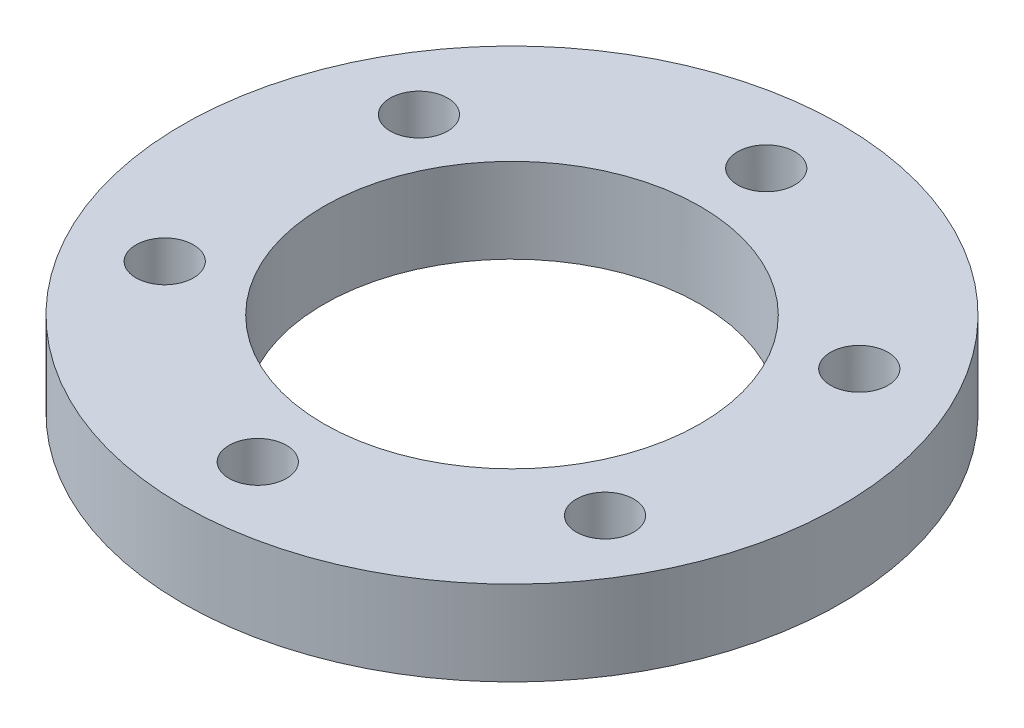
ISO-10303-21;
HEADER;
FILE_DESCRIPTION(('STEP AP214'),'2;1');
FILE_NAME('part.step','',(''),(''),'','','');
FILE_SCHEMA(('AUTOMOTIVE_DESIGN { 1 0 10303 214 1 1 1 1 }'));
ENDSEC;
DATA;
#1=APPLICATION_CONTEXT('core data for automotive mechanical design processes');
#2=APPLICATION_PROTOCOL_DEFINITION('international standard','automotive_design',2000,#1);
#3=PRODUCT_CONTEXT('',#1,'mechanical');
#4=PRODUCT('Part','Part','',(#3));
#5=PRODUCT_RELATED_PRODUCT_CATEGORY('part','',(#4));
#6=PRODUCT_DEFINITION_FORMATION('','',#4);
#7=PRODUCT_DEFINITION_CONTEXT('part definition',#1,'design');
#8=PRODUCT_DEFINITION('design','',#6,#7);
#9=PRODUCT_DEFINITION_SHAPE('','',#8);
#10=(LENGTH_UNIT() NAMED_UNIT(*) SI_UNIT(.MILLI.,.METRE.));
#11=(NAMED_UNIT(*) PLANE_ANGLE_UNIT() SI_UNIT($,.RADIAN.));
#12=(NAMED_UNIT(*) SI_UNIT($,.STERADIAN.) SOLID_ANGLE_UNIT());
#13=UNCERTAINTY_MEASURE_WITH_UNIT(LENGTH_MEASURE(1.E-05),#10,'distance_accuracy_value','');
#14=(GEOMETRIC_REPRESENTATION_CONTEXT(3) GLOBAL_UNCERTAINTY_ASSIGNED_CONTEXT((#13)) GLOBAL_UNIT_ASSIGNED_CONTEXT((#10,
#11,#12)) REPRESENTATION_CONTEXT('',''));
#15=CARTESIAN_POINT('',(0.,0.,0.));
#16=DIRECTION('',(0.,0.,1.));
#17=DIRECTION('',(1.,0.,0.));
#18=AXIS2_PLACEMENT_3D('',#15,#16,#17);
#19=CARTESIAN_POINT('',(0.,4.5,0.));
#20=DIRECTION('',(0.,1.,0.));
#21=DIRECTION('',(0.,0.,1.));
#22=AXIS2_PLACEMENT_3D('',#19,#20,#21);
#23=PLANE('',#22);
#24=CARTESIAN_POINT('',(11.6913429510899,4.5,6.75));
#25=DIRECTION('',(0.,1.,0.));
#26=DIRECTION('',(0.,0.,1.));
#27=AXIS2_PLACEMENT_3D('',#24,#25,#26);
#28=CIRCLE('',#27,1.525);
#29=CARTESIAN_POINT('',(11.6913429510899,4.5,8.275));
#30=VERTEX_POINT('',#29);
#31=EDGE_CURVE('E51',#30,#30,#28,.F.);
#32=ORIENTED_EDGE('',*,*,#31,.T.);
#33=EDGE_LOOP('',(#32));
#34=FACE_BOUND('',#33,.T.);
#35=CARTESIAN_POINT('',(11.6913429510899,4.5,-6.75));
#36=DIRECTION('',(0.,1.,0.));
#37=DIRECTION('',(0.,0.,1.));
#38=AXIS2_PLACEMENT_3D('',#35,#36,#37);
#39=CIRCLE('',#38,1.525);
#40=CARTESIAN_POINT('',(11.6913429510899,4.5,-5.225));
#41=VERTEX_POINT('',#40);
#42=EDGE_CURVE('E66',#41,#41,#39,.F.);
#43=ORIENTED_EDGE('',*,*,#42,.T.);
#44=EDGE_LOOP('',(#43));
#45=FACE_BOUND('',#44,.T.);
#46=CARTESIAN_POINT('',(0.,4.5,-13.5));
#47=DIRECTION('',(0.,1.,0.));
#48=DIRECTION('',(0.,0.,1.));
#49=AXIS2_PLACEMENT_3D('',#46,#47,#48);
#50=CIRCLE('',#49,1.525);
#51=CARTESIAN_POINT('',(0.,4.5,-11.975));
#52=VERTEX_POINT('',#51);
#53=EDGE_CURVE('E72',#52,#52,#50,.F.);
#54=ORIENTED_EDGE('',*,*,#53,.T.);
#55=EDGE_LOOP('',(#54));
#56=FACE_BOUND('',#55,.T.);
#57=CARTESIAN_POINT('',(-11.6913429510899,4.5,-6.75000000000001));
#58=DIRECTION('',(0.,1.,0.));
#59=DIRECTION('',(0.,0.,1.));
#60=AXIS2_PLACEMENT_3D('',#57,#58,#59);
#61=CIRCLE('',#60,1.525);
#62=CARTESIAN_POINT('',(-11.6913429510899,4.5,-5.225));
#63=VERTEX_POINT('',#62);
#64=EDGE_CURVE('E42',#63,#63,#61,.F.);
#65=ORIENTED_EDGE('',*,*,#64,.T.);
#66=EDGE_LOOP('',(#65));
#67=FACE_BOUND('',#66,.T.);
#68=CARTESIAN_POINT('',(-11.6913429510899,4.5,6.75));
#69=DIRECTION('',(0.,1.,0.));
#70=DIRECTION('',(0.,0.,1.));
#71=AXIS2_PLACEMENT_3D('',#68,#69,#70);
#72=CIRCLE('',#71,1.525);
#73=CARTESIAN_POINT('',(-11.6913429510899,4.5,8.275));
#74=VERTEX_POINT('',#73);
#75=EDGE_CURVE('E58',#74,#74,#72,.F.);
#76=ORIENTED_EDGE('',*,*,#75,.T.);
#77=EDGE_LOOP('',(#76));
#78=FACE_BOUND('',#77,.T.);
#79=CARTESIAN_POINT('',(0.,4.5,13.5));
#80=DIRECTION('',(0.,1.,0.));
#81=DIRECTION('',(0.,0.,1.));
#82=AXIS2_PLACEMENT_3D('',#79,#80,#81);
#83=CIRCLE('',#82,1.525);
#84=CARTESIAN_POINT('',(0.,4.5,15.025));
#85=VERTEX_POINT('',#84);
#86=EDGE_CURVE('E10',#85,#85,#83,.F.);
#87=ORIENTED_EDGE('',*,*,#86,.T.);
#88=EDGE_LOOP('',(#87));
#89=FACE_BOUND('',#88,.T.);
#90=CARTESIAN_POINT('',(0.,4.5,0.));
#91=DIRECTION('',(0.,1.,0.));
#92=DIRECTION('',(0.,0.,1.));
#93=AXIS2_PLACEMENT_3D('',#90,#91,#92);
#94=CIRCLE('',#93,10.);
#95=CARTESIAN_POINT('',(0.,4.5,10.));
#96=VERTEX_POINT('',#95);
#97=EDGE_CURVE('E59',#96,#96,#94,.F.);
#98=ORIENTED_EDGE('',*,*,#97,.T.);
#99=EDGE_LOOP('',(#98));
#100=FACE_BOUND('',#99,.T.);
#101=CARTESIAN_POINT('',(0.,4.5,0.));
#102=DIRECTION('',(0.,-1.,0.));
#103=DIRECTION('',(0.,0.,-1.));
#104=AXIS2_PLACEMENT_3D('',#101,#102,#103);
#105=CIRCLE('',#104,17.5);
#106=CARTESIAN_POINT('',(0.,4.5,-17.5));
#107=VERTEX_POINT('',#106);
#108=EDGE_CURVE('E140',#107,#107,#105,.T.);
#109=ORIENTED_EDGE('',*,*,#108,.F.);
#110=EDGE_LOOP('',(#109));
#111=FACE_BOUND('',#110,.T.);
#112=ADVANCED_FACE('F38',(#34,#45,#56,#67,#78,#89,#100,#111),#23,.T.);
#113=CARTESIAN_POINT('',(0.,0.,0.));
#114=DIRECTION('',(0.,1.,0.));
#115=DIRECTION('',(0.,0.,1.));
#116=AXIS2_PLACEMENT_3D('',#113,#114,#115);
#117=PLANE('',#116);
#118=CARTESIAN_POINT('',(11.6913429510899,0.,6.75));
#119=DIRECTION('',(0.,-1.,0.));
#120=DIRECTION('',(0.,0.,-1.));
#121=AXIS2_PLACEMENT_3D('',#118,#119,#120);
#122=CIRCLE('',#121,1.525);
#123=CARTESIAN_POINT('',(11.6913429510899,0.,5.225));
#124=VERTEX_POINT('',#123);
#125=EDGE_CURVE('E63',#124,#124,#122,.T.);
#126=ORIENTED_EDGE('',*,*,#125,.F.);
#127=EDGE_LOOP('',(#126));
#128=FACE_BOUND('',#127,.T.);
#129=CARTESIAN_POINT('',(11.6913429510899,0.,-6.75));
#130=DIRECTION('',(0.,-1.,0.));
#131=DIRECTION('',(0.,0.,-1.));
#132=AXIS2_PLACEMENT_3D('',#129,#130,#131);
#133=CIRCLE('',#132,1.525);
#134=CARTESIAN_POINT('',(11.6913429510899,0.,-8.275));
#135=VERTEX_POINT('',#134);
#136=EDGE_CURVE('E69',#135,#135,#133,.T.);
#137=ORIENTED_EDGE('',*,*,#136,.F.);
#138=EDGE_LOOP('',(#137));
#139=FACE_BOUND('',#138,.T.);
#140=CARTESIAN_POINT('',(0.,0.,-13.5));
#141=DIRECTION('',(0.,-1.,0.));
#142=DIRECTION('',(0.,0.,-1.));
#143=AXIS2_PLACEMENT_3D('',#140,#141,#142);
#144=CIRCLE('',#143,1.525);
#145=CARTESIAN_POINT('',(0.,0.,-15.025));
#146=VERTEX_POINT('',#145);
#147=EDGE_CURVE('E75',#146,#146,#144,.T.);
#148=ORIENTED_EDGE('',*,*,#147,.F.);
#149=EDGE_LOOP('',(#148));
#150=FACE_BOUND('',#149,.T.);
#151=CARTESIAN_POINT('',(-11.6913429510899,0.,-6.75000000000001));
#152=DIRECTION('',(0.,-1.,0.));
#153=DIRECTION('',(0.,0.,-1.));
#154=AXIS2_PLACEMENT_3D('',#151,#152,#153);
#155=CIRCLE('',#154,1.525);
#156=CARTESIAN_POINT('',(-11.6913429510899,0.,-8.27500000000001));
#157=VERTEX_POINT('',#156);
#158=EDGE_CURVE('E62',#157,#157,#155,.T.);
#159=ORIENTED_EDGE('',*,*,#158,.F.);
#160=EDGE_LOOP('',(#159));
#161=FACE_BOUND('',#160,.T.);
#162=CARTESIAN_POINT('',(-11.6913429510899,0.,6.75));
#163=DIRECTION('',(0.,-1.,0.));
#164=DIRECTION('',(0.,0.,-1.));
#165=AXIS2_PLACEMENT_3D('',#162,#163,#164);
#166=CIRCLE('',#165,1.525);
#167=CARTESIAN_POINT('',(-11.6913429510899,0.,5.225));
#168=VERTEX_POINT('',#167);
#169=EDGE_CURVE('E55',#168,#168,#166,.T.);
#170=ORIENTED_EDGE('',*,*,#169,.F.);
#171=EDGE_LOOP('',(#170));
#172=FACE_BOUND('',#171,.T.);
#173=CARTESIAN_POINT('',(0.,0.,13.5));
#174=DIRECTION('',(0.,-1.,0.));
#175=DIRECTION('',(0.,0.,-1.));
#176=AXIS2_PLACEMENT_3D('',#173,#174,#175);
#177=CIRCLE('',#176,1.525);
#178=CARTESIAN_POINT('',(0.,0.,11.975));
#179=VERTEX_POINT('',#178);
#180=EDGE_CURVE('E46',#179,#179,#177,.T.);
#181=ORIENTED_EDGE('',*,*,#180,.F.);
#182=EDGE_LOOP('',(#181));
#183=FACE_BOUND('',#182,.T.);
#184=CARTESIAN_POINT('',(0.,0.,0.));
#185=DIRECTION('',(0.,-1.,0.));
#186=DIRECTION('',(0.,0.,-1.));
#187=AXIS2_PLACEMENT_3D('',#184,#185,#186);
#188=CIRCLE('',#187,10.);
#189=CARTESIAN_POINT('',(0.,0.,-10.));
#190=VERTEX_POINT('',#189);
#191=EDGE_CURVE('E146',#190,#190,#188,.T.);
#192=ORIENTED_EDGE('',*,*,#191,.F.);
#193=EDGE_LOOP('',(#192));
#194=FACE_BOUND('',#193,.T.);
#195=CARTESIAN_POINT('',(0.,0.,0.));
#196=DIRECTION('',(0.,-1.,0.));
#197=DIRECTION('',(0.,0.,-1.));
#198=AXIS2_PLACEMENT_3D('',#195,#196,#197);
#199=CIRCLE('',#198,17.5);
#200=CARTESIAN_POINT('',(0.,0.,-17.5));
#201=VERTEX_POINT('',#200);
#202=EDGE_CURVE('E143',#201,#201,#199,.T.);
#203=ORIENTED_EDGE('',*,*,#202,.T.);
#204=EDGE_LOOP('',(#203));
#205=FACE_BOUND('',#204,.T.);
#206=ADVANCED_FACE('F40',(#128,#139,#150,#161,#172,#183,#194,#205),#117,.F.);
#207=CARTESIAN_POINT('',(11.6913429510899,8.81335136523794,6.75));
#208=DIRECTION('',(0.,-1.,0.));
#209=DIRECTION('',(0.,0.,-1.));
#210=AXIS2_PLACEMENT_3D('',#207,#208,#209);
#211=CYLINDRICAL_SURFACE('',#210,1.525);
#212=ORIENTED_EDGE('',*,*,#125,.T.);
#213=EDGE_LOOP('',(#212));
#214=FACE_BOUND('',#213,.T.);
#215=ORIENTED_EDGE('',*,*,#31,.F.);
#216=EDGE_LOOP('',(#215));
#217=FACE_BOUND('',#216,.T.);
#218=ADVANCED_FACE('F107',(#214,#217),#211,.F.);
#219=CARTESIAN_POINT('',(11.6913429510899,8.81335136523794,-6.75));
#220=DIRECTION('',(0.,-1.,0.));
#221=DIRECTION('',(0.,0.,-1.));
#222=AXIS2_PLACEMENT_3D('',#219,#220,#221);
#223=CYLINDRICAL_SURFACE('',#222,1.525);
#224=ORIENTED_EDGE('',*,*,#136,.T.);
#225=EDGE_LOOP('',(#224));
#226=FACE_BOUND('',#225,.T.);
#227=ORIENTED_EDGE('',*,*,#42,.F.);
#228=EDGE_LOOP('',(#227));
#229=FACE_BOUND('',#228,.T.);
#230=ADVANCED_FACE('F99',(#226,#229),#223,.F.);
#231=CARTESIAN_POINT('',(0.,8.81335136523794,-13.5));
#232=DIRECTION('',(0.,-1.,0.));
#233=DIRECTION('',(0.,0.,-1.));
#234=AXIS2_PLACEMENT_3D('',#231,#232,#233);
#235=CYLINDRICAL_SURFACE('',#234,1.525);
#236=ORIENTED_EDGE('',*,*,#147,.T.);
#237=EDGE_LOOP('',(#236));
#238=FACE_BOUND('',#237,.T.);
#239=ORIENTED_EDGE('',*,*,#53,.F.);
#240=EDGE_LOOP('',(#239));
#241=FACE_BOUND('',#240,.T.);
#242=ADVANCED_FACE('F90',(#238,#241),#235,.F.);
#243=CARTESIAN_POINT('',(-11.6913429510899,8.81335136523794,-6.75000000000001));
#244=DIRECTION('',(0.,-1.,0.));
#245=DIRECTION('',(0.,0.,-1.));
#246=AXIS2_PLACEMENT_3D('',#243,#244,#245);
#247=CYLINDRICAL_SURFACE('',#246,1.525);
#248=ORIENTED_EDGE('',*,*,#158,.T.);
#249=EDGE_LOOP('',(#248));
#250=FACE_BOUND('',#249,.T.);
#251=ORIENTED_EDGE('',*,*,#64,.F.);
#252=EDGE_LOOP('',(#251));
#253=FACE_BOUND('',#252,.T.);
#254=ADVANCED_FACE('F87',(#250,#253),#247,.F.);
#255=CARTESIAN_POINT('',(-11.6913429510899,8.81335136523794,6.75));
#256=DIRECTION('',(0.,-1.,0.));
#257=DIRECTION('',(0.,0.,-1.));
#258=AXIS2_PLACEMENT_3D('',#255,#256,#257);
#259=CYLINDRICAL_SURFACE('',#258,1.525);
#260=ORIENTED_EDGE('',*,*,#169,.T.);
#261=EDGE_LOOP('',(#260));
#262=FACE_BOUND('',#261,.T.);
#263=ORIENTED_EDGE('',*,*,#75,.F.);
#264=EDGE_LOOP('',(#263));
#265=FACE_BOUND('',#264,.T.);
#266=ADVANCED_FACE('F89',(#262,#265),#259,.F.);
#267=CARTESIAN_POINT('',(0.,8.81335136523794,13.5));
#268=DIRECTION('',(0.,-1.,0.));
#269=DIRECTION('',(0.,0.,-1.));
#270=AXIS2_PLACEMENT_3D('',#267,#268,#269);
#271=CYLINDRICAL_SURFACE('',#270,1.525);
#272=ORIENTED_EDGE('',*,*,#180,.T.);
#273=EDGE_LOOP('',(#272));
#274=FACE_BOUND('',#273,.T.);
#275=ORIENTED_EDGE('',*,*,#86,.F.);
#276=EDGE_LOOP('',(#275));
#277=FACE_BOUND('',#276,.T.);
#278=ADVANCED_FACE('F96',(#274,#277),#271,.F.);
#279=CARTESIAN_POINT('',(0.,32.7842712474619,0.));
#280=DIRECTION('',(0.,-1.,0.));
#281=DIRECTION('',(0.,0.,-1.));
#282=AXIS2_PLACEMENT_3D('',#279,#280,#281);
#283=CYLINDRICAL_SURFACE('',#282,10.);
#284=ORIENTED_EDGE('',*,*,#191,.T.);
#285=EDGE_LOOP('',(#284));
#286=FACE_BOUND('',#285,.T.);
#287=ORIENTED_EDGE('',*,*,#97,.F.);
#288=EDGE_LOOP('',(#287));
#289=FACE_BOUND('',#288,.T.);
#290=ADVANCED_FACE('F127',(#286,#289),#283,.F.);
#291=CARTESIAN_POINT('',(0.,4.5,0.));
#292=DIRECTION('',(0.,-1.,0.));
#293=DIRECTION('',(0.,0.,-1.));
#294=AXIS2_PLACEMENT_3D('',#291,#292,#293);
#295=CYLINDRICAL_SURFACE('',#294,17.5);
#296=ORIENTED_EDGE('',*,*,#108,.T.);
#297=EDGE_LOOP('',(#296));
#298=FACE_BOUND('',#297,.T.);
#299=ORIENTED_EDGE('',*,*,#202,.F.);
#300=EDGE_LOOP('',(#299));
#301=FACE_BOUND('',#300,.T.);
#302=ADVANCED_FACE('F131',(#298,#301),#295,.T.);
#303=CLOSED_SHELL('',(#112,#206,#218,#230,#242,#254,#266,#278,#290,#302));
#304=MANIFOLD_SOLID_BREP('B2',#303);
#305=ADVANCED_BREP_SHAPE_REPRESENTATION('',(#18,#304),#14);
#306=SHAPE_DEFINITION_REPRESENTATION(#9,#305);
ENDSEC;
END-ISO-10303-21;
